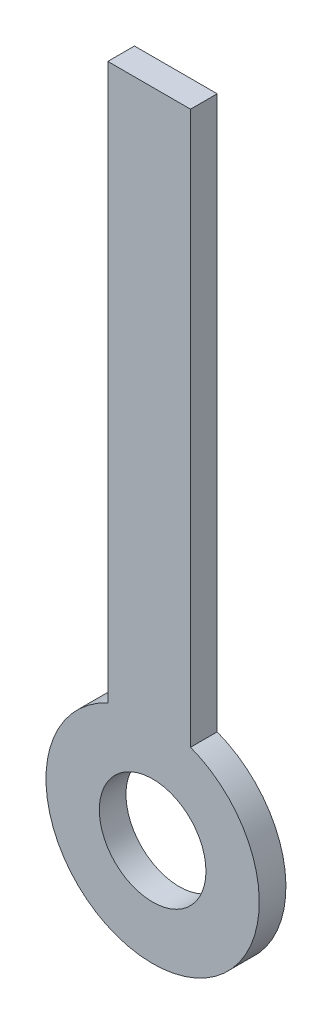
ISO-10303-21;
HEADER;
FILE_DESCRIPTION(('STEP AP214'),'2;1');
FILE_NAME('part.step','',(''),(''),'','','');
FILE_SCHEMA(('AUTOMOTIVE_DESIGN { 1 0 10303 214 1 1 1 1 }'));
ENDSEC;
DATA;
#1=APPLICATION_CONTEXT('core data for automotive mechanical design processes');
#2=APPLICATION_PROTOCOL_DEFINITION('international standard','automotive_design',2000,#1);
#3=PRODUCT_CONTEXT('',#1,'mechanical');
#4=PRODUCT('Part','Part','',(#3));
#5=PRODUCT_RELATED_PRODUCT_CATEGORY('part','',(#4));
#6=PRODUCT_DEFINITION_FORMATION('','',#4);
#7=PRODUCT_DEFINITION_CONTEXT('part definition',#1,'design');
#8=PRODUCT_DEFINITION('design','',#6,#7);
#9=PRODUCT_DEFINITION_SHAPE('','',#8);
#10=(LENGTH_UNIT() NAMED_UNIT(*) SI_UNIT(.MILLI.,.METRE.));
#11=(NAMED_UNIT(*) PLANE_ANGLE_UNIT() SI_UNIT($,.RADIAN.));
#12=(NAMED_UNIT(*) SI_UNIT($,.STERADIAN.) SOLID_ANGLE_UNIT());
#13=UNCERTAINTY_MEASURE_WITH_UNIT(LENGTH_MEASURE(1.E-05),#10,'distance_accuracy_value','');
#14=(GEOMETRIC_REPRESENTATION_CONTEXT(3) GLOBAL_UNCERTAINTY_ASSIGNED_CONTEXT((#13)) GLOBAL_UNIT_ASSIGNED_CONTEXT((#10,
#11,#12)) REPRESENTATION_CONTEXT('',''));
#15=CARTESIAN_POINT('',(0.,0.,0.));
#16=DIRECTION('',(0.,0.,1.));
#17=DIRECTION('',(1.,0.,0.));
#18=AXIS2_PLACEMENT_3D('',#15,#16,#17);
#19=CARTESIAN_POINT('',(0.,0.,2.));
#20=DIRECTION('',(0.,0.,-1.));
#21=DIRECTION('',(-1.,0.,0.));
#22=AXIS2_PLACEMENT_3D('',#19,#20,#21);
#23=CYLINDRICAL_SURFACE('',#22,8.);
#24=CARTESIAN_POINT('',(0.,0.,0.));
#25=DIRECTION('',(0.,0.,1.));
#26=DIRECTION('',(1.,0.,0.));
#27=AXIS2_PLACEMENT_3D('',#24,#25,#26);
#28=CIRCLE('',#27,8.);
#29=CARTESIAN_POINT('',(-3.3628067897999,7.25889320037674,0.));
#30=VERTEX_POINT('',#29);
#31=CARTESIAN_POINT('',(2.84231454290486,7.47805108562328,0.));
#32=VERTEX_POINT('',#31);
#33=EDGE_CURVE('E100',#30,#32,#28,.T.);
#34=ORIENTED_EDGE('',*,*,#33,.T.);
#35=DIRECTION('',(0.,0.,-1.));
#36=VECTOR('',#35,1.);
#37=CARTESIAN_POINT('',(2.84231454290486,7.47805108562328,2.));
#38=LINE('',#37,#36);
#39=CARTESIAN_POINT('',(2.84231454290486,7.47805108562328,2.));
#40=VERTEX_POINT('',#39);
#41=EDGE_CURVE('E11',#40,#32,#38,.T.);
#42=ORIENTED_EDGE('',*,*,#41,.F.);
#43=CARTESIAN_POINT('',(0.,0.,2.));
#44=DIRECTION('',(0.,0.,1.));
#45=DIRECTION('',(1.,0.,0.));
#46=AXIS2_PLACEMENT_3D('',#43,#44,#45);
#47=CIRCLE('',#46,8.);
#48=CARTESIAN_POINT('',(-3.3628067897999,7.25889320037674,2.));
#49=VERTEX_POINT('',#48);
#50=EDGE_CURVE('E101',#49,#40,#47,.T.);
#51=ORIENTED_EDGE('',*,*,#50,.F.);
#52=DIRECTION('',(0.,0.,-1.));
#53=VECTOR('',#52,1.);
#54=CARTESIAN_POINT('',(-3.3628067897999,7.25889320037674,2.));
#55=LINE('',#54,#53);
#56=EDGE_CURVE('E43',#49,#30,#55,.T.);
#57=ORIENTED_EDGE('',*,*,#56,.T.);
#58=EDGE_LOOP('',(#34,#42,#51,#57));
#59=FACE_BOUND('',#58,.T.);
#60=ADVANCED_FACE('F35',(#59),#23,.T.);
#61=CARTESIAN_POINT('',(2.84231454290486,0.,2.));
#62=DIRECTION('',(-1.,0.,0.));
#63=DIRECTION('',(0.,0.,1.));
#64=AXIS2_PLACEMENT_3D('',#61,#62,#63);
#65=PLANE('',#64);
#66=DIRECTION('',(0.,1.,0.));
#67=VECTOR('',#66,1.);
#68=CARTESIAN_POINT('',(2.84231454290486,0.,0.));
#69=LINE('',#68,#67);
#70=CARTESIAN_POINT('',(2.84231454290486,48.9356360673626,0.));
#71=VERTEX_POINT('',#70);
#72=EDGE_CURVE('E62',#32,#71,#69,.T.);
#73=ORIENTED_EDGE('',*,*,#72,.T.);
#74=DIRECTION('',(0.,0.,-1.));
#75=VECTOR('',#74,1.);
#76=CARTESIAN_POINT('',(2.84231454290486,48.9356360673626,0.));
#77=LINE('',#76,#75);
#78=CARTESIAN_POINT('',(2.84231454290486,48.9356360673626,2.));
#79=VERTEX_POINT('',#78);
#80=EDGE_CURVE('E92',#79,#71,#77,.T.);
#81=ORIENTED_EDGE('',*,*,#80,.F.);
#82=DIRECTION('',(0.,1.,0.));
#83=VECTOR('',#82,1.);
#84=CARTESIAN_POINT('',(2.84231454290486,0.,2.));
#85=LINE('',#84,#83);
#86=EDGE_CURVE('E83',#40,#79,#85,.T.);
#87=ORIENTED_EDGE('',*,*,#86,.F.);
#88=ORIENTED_EDGE('',*,*,#41,.T.);
#89=EDGE_LOOP('',(#73,#81,#87,#88));
#90=FACE_BOUND('',#89,.T.);
#91=ADVANCED_FACE('F131',(#90),#65,.F.);
#92=CARTESIAN_POINT('',(-3.3628067897999,0.,2.));
#93=DIRECTION('',(-1.,0.,0.));
#94=DIRECTION('',(0.,0.,1.));
#95=AXIS2_PLACEMENT_3D('',#92,#93,#94);
#96=PLANE('',#95);
#97=DIRECTION('',(0.,1.,0.));
#98=VECTOR('',#97,1.);
#99=CARTESIAN_POINT('',(-3.3628067897999,0.,0.));
#100=LINE('',#99,#98);
#101=CARTESIAN_POINT('',(-3.3628067897999,48.9356360673626,0.));
#102=VERTEX_POINT('',#101);
#103=EDGE_CURVE('E65',#30,#102,#100,.T.);
#104=ORIENTED_EDGE('',*,*,#103,.F.);
#105=ORIENTED_EDGE('',*,*,#56,.F.);
#106=DIRECTION('',(0.,1.,0.));
#107=VECTOR('',#106,1.);
#108=CARTESIAN_POINT('',(-3.3628067897999,0.,2.));
#109=LINE('',#108,#107);
#110=CARTESIAN_POINT('',(-3.3628067897999,48.9356360673626,2.));
#111=VERTEX_POINT('',#110);
#112=EDGE_CURVE('E75',#49,#111,#109,.T.);
#113=ORIENTED_EDGE('',*,*,#112,.T.);
#114=DIRECTION('',(0.,0.,1.));
#115=VECTOR('',#114,1.);
#116=CARTESIAN_POINT('',(-3.3628067897999,48.9356360673626,0.));
#117=LINE('',#116,#115);
#118=EDGE_CURVE('E79',#102,#111,#117,.T.);
#119=ORIENTED_EDGE('',*,*,#118,.F.);
#120=EDGE_LOOP('',(#104,#105,#113,#119));
#121=FACE_BOUND('',#120,.T.);
#122=ADVANCED_FACE('F77',(#121),#96,.T.);
#123=CARTESIAN_POINT('',(0.,0.,2.));
#124=DIRECTION('',(0.,0.,-1.));
#125=DIRECTION('',(-1.,0.,0.));
#126=AXIS2_PLACEMENT_3D('',#123,#124,#125);
#127=CYLINDRICAL_SURFACE('',#126,4.);
#128=CARTESIAN_POINT('',(0.,0.,2.));
#129=DIRECTION('',(0.,0.,1.));
#130=DIRECTION('',(1.,0.,0.));
#131=AXIS2_PLACEMENT_3D('',#128,#129,#130);
#132=CIRCLE('',#131,4.);
#133=CARTESIAN_POINT('',(4.,0.,2.));
#134=VERTEX_POINT('',#133);
#135=EDGE_CURVE('E82',#134,#134,#132,.T.);
#136=ORIENTED_EDGE('',*,*,#135,.T.);
#137=EDGE_LOOP('',(#136));
#138=FACE_BOUND('',#137,.T.);
#139=CARTESIAN_POINT('',(0.,0.,0.));
#140=DIRECTION('',(0.,0.,1.));
#141=DIRECTION('',(1.,0.,0.));
#142=AXIS2_PLACEMENT_3D('',#139,#140,#141);
#143=CIRCLE('',#142,4.);
#144=CARTESIAN_POINT('',(4.,0.,0.));
#145=VERTEX_POINT('',#144);
#146=EDGE_CURVE('E103',#145,#145,#143,.T.);
#147=ORIENTED_EDGE('',*,*,#146,.F.);
#148=EDGE_LOOP('',(#147));
#149=FACE_BOUND('',#148,.T.);
#150=ADVANCED_FACE('F120',(#138,#149),#127,.F.);
#151=CARTESIAN_POINT('',(0.,0.,2.));
#152=DIRECTION('',(0.,0.,1.));
#153=DIRECTION('',(1.,0.,0.));
#154=AXIS2_PLACEMENT_3D('',#151,#152,#153);
#155=PLANE('',#154);
#156=ORIENTED_EDGE('',*,*,#50,.T.);
#157=ORIENTED_EDGE('',*,*,#86,.T.);
#158=DIRECTION('',(1.,0.,0.));
#159=VECTOR('',#158,1.);
#160=CARTESIAN_POINT('',(-3.3628067897999,48.9356360673626,2.));
#161=LINE('',#160,#159);
#162=EDGE_CURVE('E86',#111,#79,#161,.T.);
#163=ORIENTED_EDGE('',*,*,#162,.F.);
#164=ORIENTED_EDGE('',*,*,#112,.F.);
#165=EDGE_LOOP('',(#156,#157,#163,#164));
#166=FACE_BOUND('',#165,.T.);
#167=ORIENTED_EDGE('',*,*,#135,.F.);
#168=EDGE_LOOP('',(#167));
#169=FACE_BOUND('',#168,.T.);
#170=ADVANCED_FACE('F87',(#166,#169),#155,.T.);
#171=CARTESIAN_POINT('',(0.,0.,0.));
#172=DIRECTION('',(0.,0.,1.));
#173=DIRECTION('',(1.,0.,0.));
#174=AXIS2_PLACEMENT_3D('',#171,#172,#173);
#175=PLANE('',#174);
#176=ORIENTED_EDGE('',*,*,#33,.F.);
#177=ORIENTED_EDGE('',*,*,#103,.T.);
#178=DIRECTION('',(-1.,0.,0.));
#179=VECTOR('',#178,1.);
#180=CARTESIAN_POINT('',(-3.3628067897999,48.9356360673626,0.));
#181=LINE('',#180,#179);
#182=EDGE_CURVE('E95',#71,#102,#181,.T.);
#183=ORIENTED_EDGE('',*,*,#182,.F.);
#184=ORIENTED_EDGE('',*,*,#72,.F.);
#185=EDGE_LOOP('',(#176,#177,#183,#184));
#186=FACE_BOUND('',#185,.T.);
#187=ORIENTED_EDGE('',*,*,#146,.T.);
#188=EDGE_LOOP('',(#187));
#189=FACE_BOUND('',#188,.T.);
#190=ADVANCED_FACE('F114',(#186,#189),#175,.F.);
#191=CARTESIAN_POINT('',(0.,48.9356360673626,0.));
#192=DIRECTION('',(0.,1.,0.));
#193=DIRECTION('',(0.,0.,1.));
#194=AXIS2_PLACEMENT_3D('',#191,#192,#193);
#195=PLANE('',#194);
#196=ORIENTED_EDGE('',*,*,#118,.T.);
#197=ORIENTED_EDGE('',*,*,#162,.T.);
#198=ORIENTED_EDGE('',*,*,#80,.T.);
#199=ORIENTED_EDGE('',*,*,#182,.T.);
#200=EDGE_LOOP('',(#196,#197,#198,#199));
#201=FACE_BOUND('',#200,.T.);
#202=ADVANCED_FACE('F94',(#201),#195,.T.);
#203=CLOSED_SHELL('',(#60,#91,#122,#150,#170,#190,#202));
#204=MANIFOLD_SOLID_BREP('B2',#203);
#205=ADVANCED_BREP_SHAPE_REPRESENTATION('',(#18,#204),#14);
#206=SHAPE_DEFINITION_REPRESENTATION(#9,#205);
ENDSEC;
END-ISO-10303-21;
